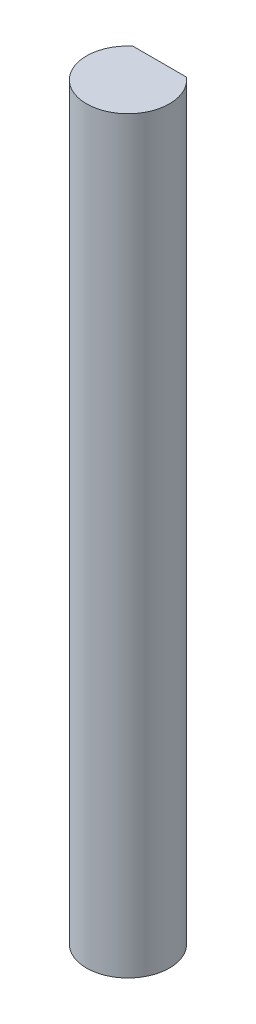
ISO-10303-21;
HEADER;
FILE_DESCRIPTION(('STEP AP214'),'2;1');
FILE_NAME('part.step','',(''),(''),'','','');
FILE_SCHEMA(('AUTOMOTIVE_DESIGN { 1 0 10303 214 1 1 1 1 }'));
ENDSEC;
DATA;
#1=APPLICATION_CONTEXT('core data for automotive mechanical design processes');
#2=APPLICATION_PROTOCOL_DEFINITION('international standard','automotive_design',2000,#1);
#3=PRODUCT_CONTEXT('',#1,'mechanical');
#4=PRODUCT('Part','Part','',(#3));
#5=PRODUCT_RELATED_PRODUCT_CATEGORY('part','',(#4));
#6=PRODUCT_DEFINITION_FORMATION('','',#4);
#7=PRODUCT_DEFINITION_CONTEXT('part definition',#1,'design');
#8=PRODUCT_DEFINITION('design','',#6,#7);
#9=PRODUCT_DEFINITION_SHAPE('','',#8);
#10=(LENGTH_UNIT() NAMED_UNIT(*) SI_UNIT(.MILLI.,.METRE.));
#11=(NAMED_UNIT(*) PLANE_ANGLE_UNIT() SI_UNIT($,.RADIAN.));
#12=(NAMED_UNIT(*) SI_UNIT($,.STERADIAN.) SOLID_ANGLE_UNIT());
#13=UNCERTAINTY_MEASURE_WITH_UNIT(LENGTH_MEASURE(1.E-05),#10,'distance_accuracy_value','');
#14=(GEOMETRIC_REPRESENTATION_CONTEXT(3) GLOBAL_UNCERTAINTY_ASSIGNED_CONTEXT((#13)) GLOBAL_UNIT_ASSIGNED_CONTEXT((#10,
#11,#12)) REPRESENTATION_CONTEXT('',''));
#15=CARTESIAN_POINT('',(0.,0.,0.));
#16=DIRECTION('',(0.,0.,1.));
#17=DIRECTION('',(1.,0.,0.));
#18=AXIS2_PLACEMENT_3D('',#15,#16,#17);
#19=CARTESIAN_POINT('',(0.,28.575,0.));
#20=DIRECTION('',(0.,-1.,0.));
#21=DIRECTION('',(0.,0.,-1.));
#22=AXIS2_PLACEMENT_3D('',#19,#20,#21);
#23=CYLINDRICAL_SURFACE('',#22,3.16865);
#24=CARTESIAN_POINT('',(0.,-28.575,0.));
#25=DIRECTION('',(0.,1.,0.));
#26=DIRECTION('',(0.,0.,1.));
#27=AXIS2_PLACEMENT_3D('',#24,#25,#26);
#28=CIRCLE('',#27,3.16865);
#29=CARTESIAN_POINT('',(-2.0492369912726,-28.575,-2.41681));
#30=VERTEX_POINT('',#29);
#31=CARTESIAN_POINT('',(2.0492369912726,-28.575,-2.41681));
#32=VERTEX_POINT('',#31);
#33=EDGE_CURVE('E63',#30,#32,#28,.T.);
#34=ORIENTED_EDGE('',*,*,#33,.T.);
#35=DIRECTION('',(0.,-1.,0.));
#36=VECTOR('',#35,1.);
#37=CARTESIAN_POINT('',(2.0492369912726,28.575,-2.41681));
#38=LINE('',#37,#36);
#39=CARTESIAN_POINT('',(2.0492369912726,28.575,-2.41681));
#40=VERTEX_POINT('',#39);
#41=EDGE_CURVE('E11',#40,#32,#38,.T.);
#42=ORIENTED_EDGE('',*,*,#41,.F.);
#43=CARTESIAN_POINT('',(0.,28.575,0.));
#44=DIRECTION('',(0.,1.,0.));
#45=DIRECTION('',(0.,0.,1.));
#46=AXIS2_PLACEMENT_3D('',#43,#44,#45);
#47=CIRCLE('',#46,3.16865);
#48=CARTESIAN_POINT('',(-2.0492369912726,28.575,-2.41681));
#49=VERTEX_POINT('',#48);
#50=EDGE_CURVE('E62',#49,#40,#47,.T.);
#51=ORIENTED_EDGE('',*,*,#50,.F.);
#52=DIRECTION('',(0.,-1.,0.));
#53=VECTOR('',#52,1.);
#54=CARTESIAN_POINT('',(-2.0492369912726,28.575,-2.41681));
#55=LINE('',#54,#53);
#56=EDGE_CURVE('E40',#49,#30,#55,.T.);
#57=ORIENTED_EDGE('',*,*,#56,.T.);
#58=EDGE_LOOP('',(#34,#42,#51,#57));
#59=FACE_BOUND('',#58,.T.);
#60=ADVANCED_FACE('F32',(#59),#23,.T.);
#61=CARTESIAN_POINT('',(-2.0492369912726,28.575,-2.41681));
#62=DIRECTION('',(0.,0.,1.));
#63=DIRECTION('',(1.,0.,0.));
#64=AXIS2_PLACEMENT_3D('',#61,#62,#63);
#65=PLANE('',#64);
#66=DIRECTION('',(-1.,0.,0.));
#67=VECTOR('',#66,1.);
#68=CARTESIAN_POINT('',(-2.0492369912726,-28.575,-2.41681));
#69=LINE('',#68,#67);
#70=EDGE_CURVE('E55',#32,#30,#69,.T.);
#71=ORIENTED_EDGE('',*,*,#70,.T.);
#72=ORIENTED_EDGE('',*,*,#56,.F.);
#73=DIRECTION('',(-1.,0.,0.));
#74=VECTOR('',#73,1.);
#75=CARTESIAN_POINT('',(-2.0492369912726,28.575,-2.41681));
#76=LINE('',#75,#74);
#77=EDGE_CURVE('E47',#40,#49,#76,.T.);
#78=ORIENTED_EDGE('',*,*,#77,.F.);
#79=ORIENTED_EDGE('',*,*,#41,.T.);
#80=EDGE_LOOP('',(#71,#72,#78,#79));
#81=FACE_BOUND('',#80,.T.);
#82=ADVANCED_FACE('F58',(#81),#65,.F.);
#83=CARTESIAN_POINT('',(0.,28.575,0.));
#84=DIRECTION('',(0.,1.,0.));
#85=DIRECTION('',(0.,0.,1.));
#86=AXIS2_PLACEMENT_3D('',#83,#84,#85);
#87=PLANE('',#86);
#88=ORIENTED_EDGE('',*,*,#50,.T.);
#89=ORIENTED_EDGE('',*,*,#77,.T.);
#90=EDGE_LOOP('',(#88,#89));
#91=FACE_BOUND('',#90,.T.);
#92=ADVANCED_FACE('F70',(#91),#87,.T.);
#93=CARTESIAN_POINT('',(0.,-28.575,0.));
#94=DIRECTION('',(0.,1.,0.));
#95=DIRECTION('',(0.,0.,1.));
#96=AXIS2_PLACEMENT_3D('',#93,#94,#95);
#97=PLANE('',#96);
#98=ORIENTED_EDGE('',*,*,#33,.F.);
#99=ORIENTED_EDGE('',*,*,#70,.F.);
#100=EDGE_LOOP('',(#98,#99));
#101=FACE_BOUND('',#100,.T.);
#102=ADVANCED_FACE('F66',(#101),#97,.F.);
#103=CLOSED_SHELL('',(#60,#82,#92,#102));
#104=MANIFOLD_SOLID_BREP('B2',#103);
#105=ADVANCED_BREP_SHAPE_REPRESENTATION('',(#18,#104),#14);
#106=SHAPE_DEFINITION_REPRESENTATION(#9,#105);
ENDSEC;
END-ISO-10303-21;
